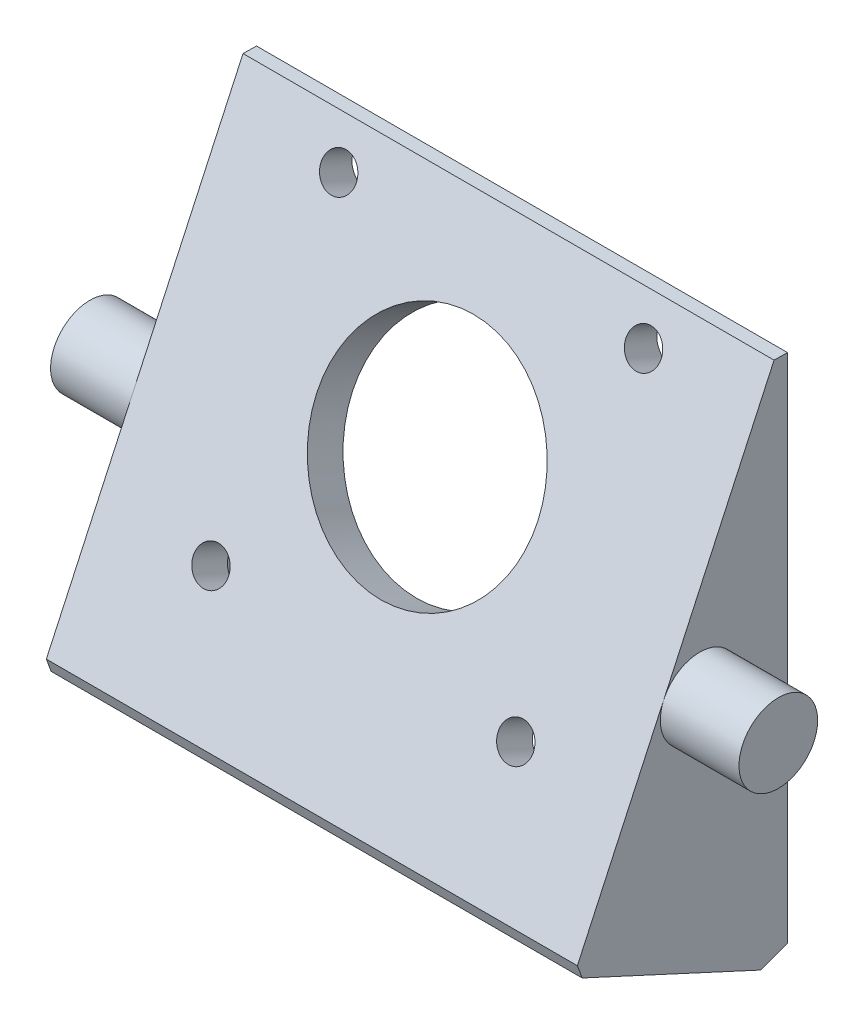
ISO-10303-21;
HEADER;
FILE_DESCRIPTION(('STEP AP214'),'2;1');
FILE_NAME('part.step','',(''),(''),'','','');
FILE_SCHEMA(('AUTOMOTIVE_DESIGN { 1 0 10303 214 1 1 1 1 }'));
ENDSEC;
DATA;
#1=APPLICATION_CONTEXT('core data for automotive mechanical design processes');
#2=APPLICATION_PROTOCOL_DEFINITION('international standard','automotive_design',2000,#1);
#3=PRODUCT_CONTEXT('',#1,'mechanical');
#4=PRODUCT('Part','Part','',(#3));
#5=PRODUCT_RELATED_PRODUCT_CATEGORY('part','',(#4));
#6=PRODUCT_DEFINITION_FORMATION('','',#4);
#7=PRODUCT_DEFINITION_CONTEXT('part definition',#1,'design');
#8=PRODUCT_DEFINITION('design','',#6,#7);
#9=PRODUCT_DEFINITION_SHAPE('','',#8);
#10=(LENGTH_UNIT() NAMED_UNIT(*) SI_UNIT(.MILLI.,.METRE.));
#11=(NAMED_UNIT(*) PLANE_ANGLE_UNIT() SI_UNIT($,.RADIAN.));
#12=(NAMED_UNIT(*) SI_UNIT($,.STERADIAN.) SOLID_ANGLE_UNIT());
#13=UNCERTAINTY_MEASURE_WITH_UNIT(LENGTH_MEASURE(1.E-05),#10,'distance_accuracy_value','');
#14=(GEOMETRIC_REPRESENTATION_CONTEXT(3) GLOBAL_UNCERTAINTY_ASSIGNED_CONTEXT((#13)) GLOBAL_UNIT_ASSIGNED_CONTEXT((#10,
#11,#12)) REPRESENTATION_CONTEXT('',''));
#15=CARTESIAN_POINT('',(0.,0.,0.));
#16=DIRECTION('',(0.,0.,1.));
#17=DIRECTION('',(1.,0.,0.));
#18=AXIS2_PLACEMENT_3D('',#15,#16,#17);
#19=CARTESIAN_POINT('',(27.,28.6356421265527,0.));
#20=DIRECTION('',(0.,0.,1.));
#21=DIRECTION('',(1.,0.,0.));
#22=AXIS2_PLACEMENT_3D('',#19,#20,#21);
#23=PLANE('',#22);
#24=DIRECTION('',(0.,1.,0.));
#25=VECTOR('',#24,1.);
#26=CARTESIAN_POINT('',(27.,28.6356421265527,0.));
#27=LINE('',#26,#25);
#28=CARTESIAN_POINT('',(27.,-26.3749335376143,0.));
#29=VERTEX_POINT('',#28);
#30=CARTESIAN_POINT('',(27.,25.6356421265527,0.));
#31=VERTEX_POINT('',#30);
#32=EDGE_CURVE('E189',#29,#31,#27,.T.);
#33=ORIENTED_EDGE('',*,*,#32,.F.);
#34=DIRECTION('',(-1.,0.,0.));
#35=VECTOR('',#34,1.);
#36=CARTESIAN_POINT('',(27.,-26.3749335376143,0.));
#37=LINE('',#36,#35);
#38=CARTESIAN_POINT('',(-27.,-26.3749335376143,0.));
#39=VERTEX_POINT('',#38);
#40=EDGE_CURVE('E215',#29,#39,#37,.T.);
#41=ORIENTED_EDGE('',*,*,#40,.T.);
#42=DIRECTION('',(0.,1.,0.));
#43=VECTOR('',#42,1.);
#44=CARTESIAN_POINT('',(-27.,28.6356421265527,0.));
#45=LINE('',#44,#43);
#46=CARTESIAN_POINT('',(-27.,25.6356421265527,0.));
#47=VERTEX_POINT('',#46);
#48=EDGE_CURVE('E180',#39,#47,#45,.T.);
#49=ORIENTED_EDGE('',*,*,#48,.T.);
#50=DIRECTION('',(1.,0.,0.));
#51=VECTOR('',#50,1.);
#52=CARTESIAN_POINT('',(27.,25.6356421265527,0.));
#53=LINE('',#52,#51);
#54=EDGE_CURVE('E211',#47,#31,#53,.T.);
#55=ORIENTED_EDGE('',*,*,#54,.T.);
#56=EDGE_LOOP('',(#33,#41,#49,#55));
#57=FACE_BOUND('',#56,.T.);
#58=DIRECTION('',(-1.,0.,0.));
#59=VECTOR('',#58,1.);
#60=CARTESIAN_POINT('',(27.,19.0904280843685,0.));
#61=LINE('',#60,#59);
#62=CARTESIAN_POINT('',(14.1292743203365,19.0904280843685,0.));
#63=VERTEX_POINT('',#62);
#64=CARTESIAN_POINT('',(-14.1292743203365,19.0904280843685,0.));
#65=VERTEX_POINT('',#64);
#66=EDGE_CURVE('E291',#63,#65,#61,.T.);
#67=ORIENTED_EDGE('',*,*,#66,.T.);
#68=CARTESIAN_POINT('',(-15.5,20.3753607438933,0.));
#69=DIRECTION('',(0.,0.,1.));
#70=DIRECTION('',(0.,-1.,0.));
#71=AXIS2_PLACEMENT_3D('',#68,#69,#70);
#72=ELLIPSE('',#71,1.98246753183826,1.8);
#73=CARTESIAN_POINT('',(-16.8707256796635,19.0904280843685,0.));
#74=VERTEX_POINT('',#73);
#75=EDGE_CURVE('E338',#74,#65,#72,.F.);
#76=ORIENTED_EDGE('',*,*,#75,.F.);
#77=CARTESIAN_POINT('',(-21.,19.0904280843685,0.));
#78=VERTEX_POINT('',#77);
#79=EDGE_CURVE('E292',#74,#78,#61,.T.);
#80=ORIENTED_EDGE('',*,*,#79,.T.);
#81=CARTESIAN_POINT('',(-21.,14.3178210632763,0.));
#82=DIRECTION('',(0.,0.,1.));
#83=DIRECTION('',(0.,1.,0.));
#84=AXIS2_PLACEMENT_3D('',#81,#82,#83);
#85=ELLIPSE('',#84,4.77260702109212,2.);
#86=CARTESIAN_POINT('',(-23.,14.3178210632763,0.));
#87=VERTEX_POINT('',#86);
#88=EDGE_CURVE('E246',#78,#87,#85,.T.);
#89=ORIENTED_EDGE('',*,*,#88,.T.);
#90=DIRECTION('',(0.,1.,0.));
#91=VECTOR('',#90,1.);
#92=CARTESIAN_POINT('',(-23.,28.6356421265527,0.));
#93=LINE('',#92,#91);
#94=CARTESIAN_POINT('',(-23.,-22.0274170204251,0.));
#95=VERTEX_POINT('',#94);
#96=EDGE_CURVE('E185',#95,#87,#93,.T.);
#97=ORIENTED_EDGE('',*,*,#96,.F.);
#98=CARTESIAN_POINT('',(-21.,-22.0274170204251,0.));
#99=DIRECTION('',(0.,0.,1.));
#100=DIRECTION('',(0.,1.,0.));
#101=AXIS2_PLACEMENT_3D('',#98,#99,#100);
#102=ELLIPSE('',#101,2.20274170204252,2.);
#103=CARTESIAN_POINT('',(-21.,-24.2301587224677,0.));
#104=VERTEX_POINT('',#103);
#105=EDGE_CURVE('E244',#95,#104,#102,.T.);
#106=ORIENTED_EDGE('',*,*,#105,.T.);
#107=DIRECTION('',(-1.,0.,0.));
#108=VECTOR('',#107,1.);
#109=CARTESIAN_POINT('',(27.,-24.2301587224677,0.));
#110=LINE('',#109,#108);
#111=CARTESIAN_POINT('',(21.,-24.2301587224677,0.));
#112=VERTEX_POINT('',#111);
#113=EDGE_CURVE('E290',#112,#104,#110,.T.);
#114=ORIENTED_EDGE('',*,*,#113,.F.);
#115=CARTESIAN_POINT('',(21.,-22.0274170204251,0.));
#116=DIRECTION('',(0.,0.,1.));
#117=DIRECTION('',(0.,-1.,0.));
#118=AXIS2_PLACEMENT_3D('',#115,#116,#117);
#119=ELLIPSE('',#118,2.20274170204252,2.);
#120=CARTESIAN_POINT('',(23.,-22.0274170204251,0.));
#121=VERTEX_POINT('',#120);
#122=EDGE_CURVE('E13',#112,#121,#119,.T.);
#123=ORIENTED_EDGE('',*,*,#122,.T.);
#124=DIRECTION('',(0.,1.,0.));
#125=VECTOR('',#124,1.);
#126=CARTESIAN_POINT('',(23.,28.6356421265527,0.));
#127=LINE('',#126,#125);
#128=CARTESIAN_POINT('',(23.,14.3178210632763,0.));
#129=VERTEX_POINT('',#128);
#130=EDGE_CURVE('E293',#121,#129,#127,.T.);
#131=ORIENTED_EDGE('',*,*,#130,.T.);
#132=CARTESIAN_POINT('',(21.,14.3178210632763,0.));
#133=DIRECTION('',(0.,0.,1.));
#134=DIRECTION('',(0.,-1.,0.));
#135=AXIS2_PLACEMENT_3D('',#132,#133,#134);
#136=ELLIPSE('',#135,4.77260702109212,2.);
#137=CARTESIAN_POINT('',(21.,19.0904280843685,0.));
#138=VERTEX_POINT('',#137);
#139=EDGE_CURVE('E57',#129,#138,#136,.T.);
#140=ORIENTED_EDGE('',*,*,#139,.T.);
#141=CARTESIAN_POINT('',(16.8707256796635,19.0904280843685,0.));
#142=VERTEX_POINT('',#141);
#143=EDGE_CURVE('E288',#138,#142,#61,.T.);
#144=ORIENTED_EDGE('',*,*,#143,.T.);
#145=CARTESIAN_POINT('',(15.5,20.3753607438933,0.));
#146=DIRECTION('',(0.,0.,1.));
#147=DIRECTION('',(0.,-1.,0.));
#148=AXIS2_PLACEMENT_3D('',#145,#146,#147);
#149=ELLIPSE('',#148,1.98246753183827,1.80000000000001);
#150=EDGE_CURVE('E330',#63,#142,#149,.F.);
#151=ORIENTED_EDGE('',*,*,#150,.F.);
#152=EDGE_LOOP('',(#67,#76,#80,#89,#97,#106,#114,#123,#131,#140,#144,#151));
#153=FACE_BOUND('',#152,.T.);
#154=ADVANCED_FACE('F48',(#57,#153),#23,.F.);
#155=CARTESIAN_POINT('',(27.,-18.5782458674708,21.7910252280109));
#156=DIRECTION('',(0.,-0.419058177461747,-0.907959384500452));
#157=DIRECTION('',(0.,0.907959384500452,-0.419058177461747));
#158=AXIS2_PLACEMENT_3D('',#155,#156,#157);
#159=PLANE('',#158);
#160=CARTESIAN_POINT('',(15.5,-6.32079417671467,16.1337398322773));
#161=DIRECTION('',(0.,-0.419058177461747,-0.907959384500452));
#162=DIRECTION('',(0.,0.907959384500452,-0.419058177461747));
#163=AXIS2_PLACEMENT_3D('',#160,#161,#162);
#164=CIRCLE('',#163,1.8);
#165=CARTESIAN_POINT('',(15.5,-4.68646728461386,15.3794351128461));
#166=VERTEX_POINT('',#165);
#167=EDGE_CURVE('E270',#166,#166,#164,.F.);
#168=ORIENTED_EDGE('',*,*,#167,.F.);
#169=EDGE_LOOP('',(#168));
#170=FACE_BOUND('',#169,.T.);
#171=CARTESIAN_POINT('',(-15.5,-6.32079417671467,16.1337398322773));
#172=DIRECTION('',(0.,-0.419058177461747,-0.907959384500452));
#173=DIRECTION('',(0.,0.907959384500452,-0.419058177461747));
#174=AXIS2_PLACEMENT_3D('',#171,#172,#173);
#175=CIRCLE('',#174,1.8);
#176=CARTESIAN_POINT('',(-15.5,-4.68646728461386,15.3794351128461));
#177=VERTEX_POINT('',#176);
#178=EDGE_CURVE('E278',#177,#177,#175,.F.);
#179=ORIENTED_EDGE('',*,*,#178,.F.);
#180=EDGE_LOOP('',(#179));
#181=FACE_BOUND('',#180,.T.);
#182=CARTESIAN_POINT('',(-15.5,21.8259467427993,3.1429363309631));
#183=DIRECTION('',(0.,-0.419058177461747,-0.907959384500452));
#184=DIRECTION('',(0.,0.907959384500452,-0.419058177461747));
#185=AXIS2_PLACEMENT_3D('',#182,#183,#184);
#186=CIRCLE('',#185,1.8);
#187=CARTESIAN_POINT('',(-15.5,23.4602736349001,2.38863161153196));
#188=VERTEX_POINT('',#187);
#189=EDGE_CURVE('E334',#188,#188,#186,.F.);
#190=ORIENTED_EDGE('',*,*,#189,.F.);
#191=EDGE_LOOP('',(#190));
#192=FACE_BOUND('',#191,.T.);
#193=CARTESIAN_POINT('',(15.5,21.8259467427993,3.1429363309631));
#194=DIRECTION('',(0.,-0.419058177461747,-0.907959384500452));
#195=DIRECTION('',(0.,0.907959384500452,-0.419058177461747));
#196=AXIS2_PLACEMENT_3D('',#193,#194,#195);
#197=CIRCLE('',#196,1.80000000000001);
#198=CARTESIAN_POINT('',(15.5,23.4602736349002,2.38863161153195));
#199=VERTEX_POINT('',#198);
#200=EDGE_CURVE('E285',#199,#199,#197,.F.);
#201=ORIENTED_EDGE('',*,*,#200,.F.);
#202=EDGE_LOOP('',(#201));
#203=FACE_BOUND('',#202,.T.);
#204=CARTESIAN_POINT('',(0.,7.75257628304233,9.63833808162018));
#205=DIRECTION('',(0.,-0.419058177461747,-0.907959384500452));
#206=DIRECTION('',(0.,0.907959384500452,-0.419058177461747));
#207=AXIS2_PLACEMENT_3D('',#204,#205,#206);
#208=CIRCLE('',#207,11.25);
#209=CARTESIAN_POINT('',(0.,17.9671193586724,4.92393358517553));
#210=VERTEX_POINT('',#209);
#211=EDGE_CURVE('E284',#210,#210,#208,.F.);
#212=ORIENTED_EDGE('',*,*,#211,.F.);
#213=EDGE_LOOP('',(#212));
#214=FACE_BOUND('',#213,.T.);
#215=DIRECTION('',(0.,-0.907959384500452,0.419058177461747));
#216=VECTOR('',#215,1.);
#217=CARTESIAN_POINT('',(27.,-18.5782458674708,21.7910252280109));
#218=LINE('',#217,#216);
#219=CARTESIAN_POINT('',(27.,25.6596175277527,1.37354981483078));
#220=VERTEX_POINT('',#219);
#221=CARTESIAN_POINT('',(27.,1.39686059153917,12.5717453238524));
#222=VERTEX_POINT('',#221);
#223=EDGE_CURVE('E162',#220,#222,#218,.T.);
#224=ORIENTED_EDGE('',*,*,#223,.F.);
#225=DIRECTION('',(-1.,0.,0.));
#226=VECTOR('',#225,1.);
#227=CARTESIAN_POINT('',(27.,25.6596175277527,1.37354981483078));
#228=LINE('',#227,#226);
#229=CARTESIAN_POINT('',(-27.,25.6596175277527,1.37354981483078));
#230=VERTEX_POINT('',#229);
#231=EDGE_CURVE('E206',#220,#230,#228,.T.);
#232=ORIENTED_EDGE('',*,*,#231,.T.);
#233=DIRECTION('',(0.,-0.907959384500452,0.419058177461747));
#234=VECTOR('',#233,1.);
#235=CARTESIAN_POINT('',(-27.,-18.5782458674708,21.7910252280109));
#236=LINE('',#235,#234);
#237=CARTESIAN_POINT('',(-27.,1.39686059153917,12.5717453238524));
#238=VERTEX_POINT('',#237);
#239=EDGE_CURVE('E192',#230,#238,#236,.T.);
#240=ORIENTED_EDGE('',*,*,#239,.T.);
#241=CARTESIAN_POINT('',(-27.,-17.6702864829703,21.3719670505491));
#242=VERTEX_POINT('',#241);
#243=EDGE_CURVE('E195',#238,#242,#236,.T.);
#244=ORIENTED_EDGE('',*,*,#243,.T.);
#245=DIRECTION('',(1.,0.,0.));
#246=VECTOR('',#245,1.);
#247=CARTESIAN_POINT('',(27.,-17.6702864829703,21.3719670505491));
#248=LINE('',#247,#246);
#249=CARTESIAN_POINT('',(27.,-17.6702864829703,21.3719670505491));
#250=VERTEX_POINT('',#249);
#251=EDGE_CURVE('E178',#242,#250,#248,.T.);
#252=ORIENTED_EDGE('',*,*,#251,.T.);
#253=EDGE_CURVE('E173',#222,#250,#218,.T.);
#254=ORIENTED_EDGE('',*,*,#253,.F.);
#255=EDGE_LOOP('',(#224,#232,#240,#244,#252,#254));
#256=FACE_BOUND('',#255,.T.);
#257=ADVANCED_FACE('F176',(#170,#181,#192,#203,#214,#256),#159,.F.);
#258=CARTESIAN_POINT('',(27.,-28.6356421265527,0.));
#259=DIRECTION('',(0.,0.907959384500452,-0.419058177461747));
#260=DIRECTION('',(0.,0.419058177461747,0.907959384500452));
#261=AXIS2_PLACEMENT_3D('',#258,#259,#260);
#262=PLANE('',#261);
#263=DIRECTION('',(0.,-0.419058177461747,-0.907959384500452));
#264=VECTOR('',#263,1.);
#265=CARTESIAN_POINT('',(-27.,-28.6356421265527,0.));
#266=LINE('',#265,#264);
#267=CARTESIAN_POINT('',(-27.,-18.9973040449325,20.8830658435104));
#268=VERTEX_POINT('',#267);
#269=CARTESIAN_POINT('',(-27.,-27.3784675941674,2.72387815350138));
#270=VERTEX_POINT('',#269);
#271=EDGE_CURVE('E181',#268,#270,#266,.T.);
#272=ORIENTED_EDGE('',*,*,#271,.T.);
#273=DIRECTION('',(1.,0.,0.));
#274=VECTOR('',#273,1.);
#275=CARTESIAN_POINT('',(27.,-27.3784675941674,2.72387815350138));
#276=LINE('',#275,#274);
#277=CARTESIAN_POINT('',(27.,-27.3784675941674,2.72387815350138));
#278=VERTEX_POINT('',#277);
#279=EDGE_CURVE('E220',#270,#278,#276,.T.);
#280=ORIENTED_EDGE('',*,*,#279,.T.);
#281=DIRECTION('',(0.,-0.419058177461747,-0.907959384500452));
#282=VECTOR('',#281,1.);
#283=CARTESIAN_POINT('',(27.,-28.6356421265527,0.));
#284=LINE('',#283,#282);
#285=CARTESIAN_POINT('',(27.,-18.9973040449325,20.8830658435104));
#286=VERTEX_POINT('',#285);
#287=EDGE_CURVE('E172',#286,#278,#284,.T.);
#288=ORIENTED_EDGE('',*,*,#287,.F.);
#289=DIRECTION('',(-1.,0.,0.));
#290=VECTOR('',#289,1.);
#291=CARTESIAN_POINT('',(27.,-18.9973040449325,20.8830658435104));
#292=LINE('',#291,#290);
#293=EDGE_CURVE('E191',#286,#268,#292,.T.);
#294=ORIENTED_EDGE('',*,*,#293,.T.);
#295=EDGE_LOOP('',(#272,#280,#288,#294));
#296=FACE_BOUND('',#295,.T.);
#297=ADVANCED_FACE('F310',(#296),#262,.F.);
#298=CARTESIAN_POINT('',(27.,0.,0.));
#299=DIRECTION('',(1.,0.,0.));
#300=DIRECTION('',(0.,0.,-1.));
#301=AXIS2_PLACEMENT_3D('',#298,#299,#300);
#302=PLANE('',#301);
#303=ORIENTED_EDGE('',*,*,#223,.T.);
#304=CARTESIAN_POINT('',(27.,-0.279372118307818,8.9399077858506));
#305=DIRECTION('',(1.,0.,0.));
#306=DIRECTION('',(0.,0.,-1.));
#307=AXIS2_PLACEMENT_3D('',#304,#305,#306);
#308=CIRCLE('',#307,4.);
#309=EDGE_CURVE('E166',#222,#222,#308,.T.);
#310=ORIENTED_EDGE('',*,*,#309,.F.);
#311=ORIENTED_EDGE('',*,*,#253,.T.);
#312=DIRECTION('',(0.,0.938343116817111,0.345705358827355));
#313=VECTOR('',#312,1.);
#314=CARTESIAN_POINT('',(27.,-9.04467233021601,24.5498248963007));
#315=LINE('',#314,#313);
#316=EDGE_CURVE('E204',#250,#286,#315,.F.);
#317=ORIENTED_EDGE('',*,*,#316,.T.);
#318=ORIENTED_EDGE('',*,*,#287,.T.);
#319=DIRECTION('',(0.,-0.345705358827357,0.93834311681711));
#320=VECTOR('',#319,1.);
#321=CARTESIAN_POINT('',(27.,-23.2228073343384,-8.55577112317734));
#322=LINE('',#321,#320);
#323=EDGE_CURVE('E222',#278,#29,#322,.F.);
#324=ORIENTED_EDGE('',*,*,#323,.T.);
#325=ORIENTED_EDGE('',*,*,#32,.T.);
#326=DIRECTION('',(0.,-0.0174524064372765,-0.999847695156391));
#327=VECTOR('',#326,1.);
#328=CARTESIAN_POINT('',(27.,25.6278338562869,-0.44733550393088));
#329=LINE('',#328,#327);
#330=EDGE_CURVE('E168',#31,#220,#329,.F.);
#331=ORIENTED_EDGE('',*,*,#330,.T.);
#332=EDGE_LOOP('',(#303,#310,#311,#317,#318,#324,#325,#331));
#333=FACE_BOUND('',#332,.T.);
#334=ADVANCED_FACE('F164',(#333),#302,.T.);
#335=CARTESIAN_POINT('',(-27.,0.,0.));
#336=DIRECTION('',(1.,0.,0.));
#337=DIRECTION('',(0.,0.,-1.));
#338=AXIS2_PLACEMENT_3D('',#335,#336,#337);
#339=PLANE('',#338);
#340=ORIENTED_EDGE('',*,*,#243,.F.);
#341=CARTESIAN_POINT('',(-27.,-0.279372118307818,8.9399077858506));
#342=DIRECTION('',(1.,0.,0.));
#343=DIRECTION('',(0.,0.,-1.));
#344=AXIS2_PLACEMENT_3D('',#341,#342,#343);
#345=CIRCLE('',#344,4.);
#346=EDGE_CURVE('E63',#238,#238,#345,.T.);
#347=ORIENTED_EDGE('',*,*,#346,.T.);
#348=ORIENTED_EDGE('',*,*,#239,.F.);
#349=DIRECTION('',(0.,0.0174524064372765,0.999847695156391));
#350=VECTOR('',#349,1.);
#351=CARTESIAN_POINT('',(-27.,25.6596175277527,1.37354981483078));
#352=LINE('',#351,#350);
#353=EDGE_CURVE('E208',#230,#47,#352,.F.);
#354=ORIENTED_EDGE('',*,*,#353,.T.);
#355=ORIENTED_EDGE('',*,*,#48,.F.);
#356=DIRECTION('',(0.,0.345705358827357,-0.93834311681711));
#357=VECTOR('',#356,1.);
#358=CARTESIAN_POINT('',(-27.,-26.3749335376143,0.));
#359=LINE('',#358,#357);
#360=EDGE_CURVE('E218',#39,#270,#359,.F.);
#361=ORIENTED_EDGE('',*,*,#360,.T.);
#362=ORIENTED_EDGE('',*,*,#271,.F.);
#363=DIRECTION('',(0.,-0.938343116817111,-0.345705358827355));
#364=VECTOR('',#363,1.);
#365=CARTESIAN_POINT('',(-27.,-18.9973040449325,20.8830658435104));
#366=LINE('',#365,#364);
#367=EDGE_CURVE('E200',#268,#242,#366,.F.);
#368=ORIENTED_EDGE('',*,*,#367,.T.);
#369=EDGE_LOOP('',(#340,#347,#348,#354,#355,#361,#362,#368));
#370=FACE_BOUND('',#369,.T.);
#371=ADVANCED_FACE('F303',(#370),#339,.F.);
#372=CARTESIAN_POINT('',(27.,-20.2544785773178,18.159187690009));
#373=DIRECTION('',(0.,-0.419058177461747,-0.907959384500452));
#374=DIRECTION('',(0.,0.907959384500452,-0.419058177461747));
#375=AXIS2_PLACEMENT_3D('',#372,#373,#374);
#376=PLANE('',#375);
#377=CARTESIAN_POINT('',(15.5,-7.99702688656166,12.5019022942755));
#378=DIRECTION('',(0.,-0.419058177461747,-0.907959384500452));
#379=DIRECTION('',(0.,0.907959384500452,-0.419058177461747));
#380=AXIS2_PLACEMENT_3D('',#377,#378,#379);
#381=CIRCLE('',#380,1.8);
#382=CARTESIAN_POINT('',(15.5,-6.36269999446084,11.7475975748443));
#383=VERTEX_POINT('',#382);
#384=EDGE_CURVE('E267',#383,#383,#381,.T.);
#385=ORIENTED_EDGE('',*,*,#384,.F.);
#386=EDGE_LOOP('',(#385));
#387=FACE_BOUND('',#386,.T.);
#388=CARTESIAN_POINT('',(-15.5,-7.99702688656166,12.5019022942755));
#389=DIRECTION('',(0.,-0.419058177461747,-0.907959384500452));
#390=DIRECTION('',(0.,0.907959384500452,-0.419058177461747));
#391=AXIS2_PLACEMENT_3D('',#388,#389,#390);
#392=CIRCLE('',#391,1.8);
#393=CARTESIAN_POINT('',(-15.5,-6.36269999446085,11.7475975748443));
#394=VERTEX_POINT('',#393);
#395=EDGE_CURVE('E275',#394,#394,#392,.T.);
#396=ORIENTED_EDGE('',*,*,#395,.F.);
#397=EDGE_LOOP('',(#396));
#398=FACE_BOUND('',#397,.T.);
#399=DIRECTION('',(-1.,0.,0.));
#400=VECTOR('',#399,1.);
#401=CARTESIAN_POINT('',(-23.,-14.806722270315,15.6448386252386));
#402=LINE('',#401,#400);
#403=CARTESIAN_POINT('',(21.,-14.806722270315,15.6448386252386));
#404=VERTEX_POINT('',#403);
#405=CARTESIAN_POINT('',(-21.,-14.806722270315,15.6448386252386));
#406=VERTEX_POINT('',#405);
#407=EDGE_CURVE('E237',#404,#406,#402,.T.);
#408=ORIENTED_EDGE('',*,*,#407,.T.);
#409=DIRECTION('',(0.,-0.907959384500452,0.419058177461747));
#410=VECTOR('',#409,1.);
#411=CARTESIAN_POINT('',(-21.,19.0904280843685,0.));
#412=LINE('',#411,#410);
#413=EDGE_CURVE('E239',#406,#78,#412,.F.);
#414=ORIENTED_EDGE('',*,*,#413,.T.);
#415=ORIENTED_EDGE('',*,*,#79,.F.);
#416=CARTESIAN_POINT('',(-15.5,20.1497140329523,-0.488901207038706));
#417=DIRECTION('',(0.,-0.419058177461747,-0.907959384500452));
#418=DIRECTION('',(0.,0.907959384500452,-0.419058177461747));
#419=AXIS2_PLACEMENT_3D('',#416,#417,#418);
#420=CIRCLE('',#419,1.8);
#421=EDGE_CURVE('E340',#65,#74,#420,.T.);
#422=ORIENTED_EDGE('',*,*,#421,.F.);
#423=ORIENTED_EDGE('',*,*,#66,.F.);
#424=CARTESIAN_POINT('',(15.5,20.1497140329523,-0.488901207038706));
#425=DIRECTION('',(0.,-0.419058177461747,-0.907959384500452));
#426=DIRECTION('',(0.,0.907959384500452,-0.419058177461747));
#427=AXIS2_PLACEMENT_3D('',#424,#425,#426);
#428=CIRCLE('',#427,1.80000000000001);
#429=EDGE_CURVE('E333',#142,#63,#428,.T.);
#430=ORIENTED_EDGE('',*,*,#429,.F.);
#431=ORIENTED_EDGE('',*,*,#143,.F.);
#432=DIRECTION('',(0.,-0.907959384500452,0.419058177461747));
#433=VECTOR('',#432,1.);
#434=CARTESIAN_POINT('',(21.,-20.2544785773178,18.159187690009));
#435=LINE('',#434,#433);
#436=EDGE_CURVE('E235',#138,#404,#435,.T.);
#437=ORIENTED_EDGE('',*,*,#436,.T.);
#438=EDGE_LOOP('',(#408,#414,#415,#422,#423,#430,#431,#437));
#439=FACE_BOUND('',#438,.T.);
#440=CARTESIAN_POINT('',(0.,6.07634357319534,6.00650054361838));
#441=DIRECTION('',(0.,-0.419058177461747,-0.907959384500452));
#442=DIRECTION('',(0.,0.907959384500452,-0.419058177461747));
#443=AXIS2_PLACEMENT_3D('',#440,#441,#442);
#444=CIRCLE('',#443,11.25);
#445=CARTESIAN_POINT('',(0.,16.2908866488254,1.29209604717372));
#446=VERTEX_POINT('',#445);
#447=EDGE_CURVE('E281',#446,#446,#444,.T.);
#448=ORIENTED_EDGE('',*,*,#447,.F.);
#449=EDGE_LOOP('',(#448));
#450=FACE_BOUND('',#449,.T.);
#451=ADVANCED_FACE('F428',(#387,#398,#439,#450),#376,.T.);
#452=CARTESIAN_POINT('',(27.,-25.0038045885509,-1.67623270984698));
#453=DIRECTION('',(0.,0.907959384500452,-0.419058177461747));
#454=DIRECTION('',(0.,0.419058177461747,0.907959384500452));
#455=AXIS2_PLACEMENT_3D('',#452,#453,#454);
#456=PLANE('',#455);
#457=ORIENTED_EDGE('',*,*,#113,.T.);
#458=DIRECTION('',(0.,-0.419058177461747,-0.907959384500452));
#459=VECTOR('',#458,1.);
#460=CARTESIAN_POINT('',(-21.,-16.622641039316,16.4829549801621));
#461=LINE('',#460,#459);
#462=CARTESIAN_POINT('',(-21.,-17.4607573942395,14.6670362111611));
#463=VERTEX_POINT('',#462);
#464=EDGE_CURVE('E233',#104,#463,#461,.F.);
#465=ORIENTED_EDGE('',*,*,#464,.T.);
#466=DIRECTION('',(-1.,0.,0.));
#467=VECTOR('',#466,1.);
#468=CARTESIAN_POINT('',(23.,-17.4607573942394,14.6670362111611));
#469=LINE('',#468,#467);
#470=CARTESIAN_POINT('',(21.,-17.4607573942395,14.6670362111611));
#471=VERTEX_POINT('',#470);
#472=EDGE_CURVE('E231',#463,#471,#469,.F.);
#473=ORIENTED_EDGE('',*,*,#472,.T.);
#474=DIRECTION('',(0.,-0.419058177461747,-0.907959384500452));
#475=VECTOR('',#474,1.);
#476=CARTESIAN_POINT('',(21.,-25.0038045885509,-1.67623270984698));
#477=LINE('',#476,#475);
#478=EDGE_CURVE('E229',#471,#112,#477,.T.);
#479=ORIENTED_EDGE('',*,*,#478,.T.);
#480=EDGE_LOOP('',(#457,#465,#473,#479));
#481=FACE_BOUND('',#480,.T.);
#482=ADVANCED_FACE('F447',(#481),#456,.T.);
#483=CARTESIAN_POINT('',(23.,0.,0.));
#484=DIRECTION('',(1.,0.,0.));
#485=DIRECTION('',(0.,0.,-1.));
#486=AXIS2_PLACEMENT_3D('',#483,#484,#485);
#487=PLANE('',#486);
#488=DIRECTION('',(0.,-0.419058177461747,-0.907959384500452));
#489=VECTOR('',#488,1.);
#490=CARTESIAN_POINT('',(23.,-18.159187690009,8.38116354923493));
#491=LINE('',#490,#489);
#492=CARTESIAN_POINT('',(23.,-15.6448386252385,13.8289198562377));
#493=VERTEX_POINT('',#492);
#494=EDGE_CURVE('E70',#121,#493,#491,.F.);
#495=ORIENTED_EDGE('',*,*,#494,.T.);
#496=DIRECTION('',(0.,-0.907959384500452,0.419058177461747));
#497=VECTOR('',#496,1.);
#498=CARTESIAN_POINT('',(23.,2.51434906477048,5.44775630700271));
#499=LINE('',#498,#497);
#500=EDGE_CURVE('E242',#493,#129,#499,.F.);
#501=ORIENTED_EDGE('',*,*,#500,.T.);
#502=ORIENTED_EDGE('',*,*,#130,.F.);
#503=EDGE_LOOP('',(#495,#501,#502));
#504=FACE_BOUND('',#503,.T.);
#505=ADVANCED_FACE('F374',(#504),#487,.F.);
#506=CARTESIAN_POINT('',(-23.,0.,0.));
#507=DIRECTION('',(1.,0.,0.));
#508=DIRECTION('',(0.,0.,-1.));
#509=AXIS2_PLACEMENT_3D('',#506,#507,#508);
#510=PLANE('',#509);
#511=DIRECTION('',(0.,-0.907959384500452,0.419058177461747));
#512=VECTOR('',#511,1.);
#513=CARTESIAN_POINT('',(-23.,-17.4607573942395,14.6670362111612));
#514=LINE('',#513,#512);
#515=CARTESIAN_POINT('',(-23.,-15.6448386252385,13.8289198562377));
#516=VERTEX_POINT('',#515);
#517=EDGE_CURVE('E224',#87,#516,#514,.T.);
#518=ORIENTED_EDGE('',*,*,#517,.T.);
#519=DIRECTION('',(0.,-0.419058177461747,-0.907959384500452));
#520=VECTOR('',#519,1.);
#521=CARTESIAN_POINT('',(-23.,-22.4142399534668,-0.838116354923491));
#522=LINE('',#521,#520);
#523=EDGE_CURVE('E226',#516,#95,#522,.T.);
#524=ORIENTED_EDGE('',*,*,#523,.T.);
#525=ORIENTED_EDGE('',*,*,#96,.T.);
#526=EDGE_LOOP('',(#518,#524,#525));
#527=FACE_BOUND('',#526,.T.);
#528=ADVANCED_FACE('F364',(#527),#510,.T.);
#529=CARTESIAN_POINT('',(0.,16.0443517356513,27.603851562273));
#530=DIRECTION('',(0.,-0.419058177461747,-0.907959384500452));
#531=DIRECTION('',(0.,0.907959384500452,-0.419058177461747));
#532=AXIS2_PLACEMENT_3D('',#529,#530,#531);
#533=CYLINDRICAL_SURFACE('',#532,11.25);
#534=ORIENTED_EDGE('',*,*,#447,.T.);
#535=EDGE_LOOP('',(#534));
#536=FACE_BOUND('',#535,.T.);
#537=ORIENTED_EDGE('',*,*,#211,.T.);
#538=EDGE_LOOP('',(#537));
#539=FACE_BOUND('',#538,.T.);
#540=ADVANCED_FACE('F361',(#536,#539),#533,.F.);
#541=CARTESIAN_POINT('',(15.5,30.1177221954083,21.1084498116159));
#542=DIRECTION('',(0.,-0.419058177461747,-0.907959384500452));
#543=DIRECTION('',(0.,0.907959384500452,-0.419058177461747));
#544=AXIS2_PLACEMENT_3D('',#541,#542,#543);
#545=CYLINDRICAL_SURFACE('',#544,1.80000000000001);
#546=ORIENTED_EDGE('',*,*,#200,.T.);
#547=EDGE_LOOP('',(#546));
#548=FACE_BOUND('',#547,.T.);
#549=ORIENTED_EDGE('',*,*,#150,.T.);
#550=ORIENTED_EDGE('',*,*,#429,.T.);
#551=EDGE_LOOP('',(#549,#550));
#552=FACE_BOUND('',#551,.T.);
#553=ADVANCED_FACE('F363',(#548,#552),#545,.F.);
#554=CARTESIAN_POINT('',(-15.5,30.1177221954083,21.1084498116159));
#555=DIRECTION('',(0.,-0.419058177461747,-0.907959384500452));
#556=DIRECTION('',(0.,0.907959384500452,-0.419058177461747));
#557=AXIS2_PLACEMENT_3D('',#554,#555,#556);
#558=CYLINDRICAL_SURFACE('',#557,1.8);
#559=ORIENTED_EDGE('',*,*,#189,.T.);
#560=EDGE_LOOP('',(#559));
#561=FACE_BOUND('',#560,.T.);
#562=ORIENTED_EDGE('',*,*,#75,.T.);
#563=ORIENTED_EDGE('',*,*,#421,.T.);
#564=EDGE_LOOP('',(#562,#563));
#565=FACE_BOUND('',#564,.T.);
#566=ADVANCED_FACE('F371',(#561,#565),#558,.F.);
#567=CARTESIAN_POINT('',(-15.5,1.97098127589434,34.0992533129301));
#568=DIRECTION('',(0.,-0.419058177461747,-0.907959384500452));
#569=DIRECTION('',(0.,0.907959384500452,-0.419058177461747));
#570=AXIS2_PLACEMENT_3D('',#567,#568,#569);
#571=CYLINDRICAL_SURFACE('',#570,1.8);
#572=ORIENTED_EDGE('',*,*,#395,.T.);
#573=EDGE_LOOP('',(#572));
#574=FACE_BOUND('',#573,.T.);
#575=ORIENTED_EDGE('',*,*,#178,.T.);
#576=EDGE_LOOP('',(#575));
#577=FACE_BOUND('',#576,.T.);
#578=ADVANCED_FACE('F349',(#574,#577),#571,.F.);
#579=CARTESIAN_POINT('',(15.5,1.97098127589434,34.0992533129301));
#580=DIRECTION('',(0.,-0.419058177461747,-0.907959384500452));
#581=DIRECTION('',(0.,0.907959384500452,-0.419058177461747));
#582=AXIS2_PLACEMENT_3D('',#579,#580,#581);
#583=CYLINDRICAL_SURFACE('',#582,1.8);
#584=ORIENTED_EDGE('',*,*,#384,.T.);
#585=EDGE_LOOP('',(#584));
#586=FACE_BOUND('',#585,.T.);
#587=ORIENTED_EDGE('',*,*,#167,.T.);
#588=EDGE_LOOP('',(#587));
#589=FACE_BOUND('',#588,.T.);
#590=ADVANCED_FACE('F390',(#586,#589),#583,.F.);
#591=CARTESIAN_POINT('',(27.,-18.9973040449325,20.8830658435104));
#592=DIRECTION('',(0.,0.345705358827355,-0.938343116817111));
#593=DIRECTION('',(-1.,0.,0.));
#594=AXIS2_PLACEMENT_3D('',#591,#592,#593);
#595=PLANE('',#594);
#596=ORIENTED_EDGE('',*,*,#316,.F.);
#597=ORIENTED_EDGE('',*,*,#251,.F.);
#598=ORIENTED_EDGE('',*,*,#367,.F.);
#599=ORIENTED_EDGE('',*,*,#293,.F.);
#600=EDGE_LOOP('',(#596,#597,#598,#599));
#601=FACE_BOUND('',#600,.T.);
#602=ADVANCED_FACE('F306',(#601),#595,.F.);
#603=CARTESIAN_POINT('',(27.,25.6596175277527,1.37354981483078));
#604=DIRECTION('',(0.,-0.999847695156391,0.0174524064372765));
#605=DIRECTION('',(-1.,0.,0.));
#606=AXIS2_PLACEMENT_3D('',#603,#604,#605);
#607=PLANE('',#606);
#608=ORIENTED_EDGE('',*,*,#330,.F.);
#609=ORIENTED_EDGE('',*,*,#54,.F.);
#610=ORIENTED_EDGE('',*,*,#353,.F.);
#611=ORIENTED_EDGE('',*,*,#231,.F.);
#612=EDGE_LOOP('',(#608,#609,#610,#611));
#613=FACE_BOUND('',#612,.T.);
#614=ADVANCED_FACE('F321',(#613),#607,.F.);
#615=CARTESIAN_POINT('',(27.,-26.3749335376143,0.));
#616=DIRECTION('',(0.,0.93834311681711,0.345705358827357));
#617=DIRECTION('',(-1.,0.,0.));
#618=AXIS2_PLACEMENT_3D('',#615,#616,#617);
#619=PLANE('',#618);
#620=ORIENTED_EDGE('',*,*,#323,.F.);
#621=ORIENTED_EDGE('',*,*,#279,.F.);
#622=ORIENTED_EDGE('',*,*,#360,.F.);
#623=ORIENTED_EDGE('',*,*,#40,.F.);
#624=EDGE_LOOP('',(#620,#621,#622,#623));
#625=FACE_BOUND('',#624,.T.);
#626=ADVANCED_FACE('F313',(#625),#619,.F.);
#627=CARTESIAN_POINT('',(21.,-23.18788581955,-2.51434906477047));
#628=DIRECTION('',(0.,-0.419058177461747,-0.907959384500452));
#629=DIRECTION('',(0.,0.907959384500452,-0.419058177461747));
#630=AXIS2_PLACEMENT_3D('',#627,#628,#629);
#631=CYLINDRICAL_SURFACE('',#630,2.);
#632=ORIENTED_EDGE('',*,*,#122,.F.);
#633=ORIENTED_EDGE('',*,*,#478,.F.);
#634=CARTESIAN_POINT('',(21.,-15.6448386252385,13.8289198562377));
#635=DIRECTION('',(0.,-0.419058177461748,-0.907959384500451));
#636=DIRECTION('',(0.,0.907959384500451,-0.419058177461748));
#637=AXIS2_PLACEMENT_3D('',#634,#635,#636);
#638=CIRCLE('',#637,2.);
#639=EDGE_CURVE('E52',#493,#471,#638,.T.);
#640=ORIENTED_EDGE('',*,*,#639,.F.);
#641=ORIENTED_EDGE('',*,*,#494,.F.);
#642=EDGE_LOOP('',(#632,#633,#640,#641));
#643=FACE_BOUND('',#642,.T.);
#644=ADVANCED_FACE('F50',(#643),#631,.F.);
#645=CARTESIAN_POINT('',(21.,-21.0925949322413,16.3432689210081));
#646=DIRECTION('',(0.,-0.907959384500452,0.419058177461747));
#647=DIRECTION('',(0.,-0.419058177461747,-0.907959384500452));
#648=AXIS2_PLACEMENT_3D('',#645,#646,#647);
#649=CYLINDRICAL_SURFACE('',#648,2.);
#650=ORIENTED_EDGE('',*,*,#139,.F.);
#651=ORIENTED_EDGE('',*,*,#500,.F.);
#652=CARTESIAN_POINT('',(21.,-15.6448386252385,13.8289198562377));
#653=DIRECTION('',(0.,0.907959384500451,-0.419058177461747));
#654=DIRECTION('',(0.,0.419058177461747,0.907959384500452));
#655=AXIS2_PLACEMENT_3D('',#652,#653,#654);
#656=CIRCLE('',#655,2.);
#657=EDGE_CURVE('E261',#404,#493,#656,.T.);
#658=ORIENTED_EDGE('',*,*,#657,.F.);
#659=ORIENTED_EDGE('',*,*,#436,.F.);
#660=EDGE_LOOP('',(#650,#651,#658,#659));
#661=FACE_BOUND('',#660,.T.);
#662=ADVANCED_FACE('F414',(#661),#649,.F.);
#663=CARTESIAN_POINT('',(21.,-15.6448386252385,13.8289198562377));
#664=DIRECTION('',(0.,0.,1.));
#665=DIRECTION('',(1.,0.,0.));
#666=AXIS2_PLACEMENT_3D('',#663,#664,#665);
#667=SPHERICAL_SURFACE('',#666,2.);
#668=ORIENTED_EDGE('',*,*,#657,.T.);
#669=ORIENTED_EDGE('',*,*,#639,.T.);
#670=CARTESIAN_POINT('',(21.,-15.6448386252385,13.8289198562377));
#671=DIRECTION('',(-1.,0.,0.));
#672=DIRECTION('',(0.,0.,1.));
#673=AXIS2_PLACEMENT_3D('',#670,#671,#672);
#674=CIRCLE('',#673,2.);
#675=EDGE_CURVE('E259',#404,#471,#674,.F.);
#676=ORIENTED_EDGE('',*,*,#675,.F.);
#677=EDGE_LOOP('',(#668,#669,#676));
#678=FACE_BOUND('',#677,.T.);
#679=ADVANCED_FACE('F411',(#678),#667,.F.);
#680=CARTESIAN_POINT('',(27.,-15.6448386252385,13.8289198562377));
#681=DIRECTION('',(1.,0.,0.));
#682=DIRECTION('',(0.,0.,-1.));
#683=AXIS2_PLACEMENT_3D('',#680,#681,#682);
#684=CYLINDRICAL_SURFACE('',#683,2.);
#685=ORIENTED_EDGE('',*,*,#675,.T.);
#686=ORIENTED_EDGE('',*,*,#472,.F.);
#687=CARTESIAN_POINT('',(-21.,-15.6448386252385,13.8289198562377));
#688=DIRECTION('',(1.,0.,0.));
#689=DIRECTION('',(0.,0.,-1.));
#690=AXIS2_PLACEMENT_3D('',#687,#688,#689);
#691=CIRCLE('',#690,2.);
#692=EDGE_CURVE('E256',#406,#463,#691,.T.);
#693=ORIENTED_EDGE('',*,*,#692,.F.);
#694=ORIENTED_EDGE('',*,*,#407,.F.);
#695=EDGE_LOOP('',(#685,#686,#693,#694));
#696=FACE_BOUND('',#695,.T.);
#697=ADVANCED_FACE('F407',(#696),#684,.F.);
#698=CARTESIAN_POINT('',(-21.,2.51434906477048,5.44775630700271));
#699=DIRECTION('',(0.,0.907959384500452,-0.419058177461747));
#700=DIRECTION('',(0.,0.419058177461747,0.907959384500452));
#701=AXIS2_PLACEMENT_3D('',#698,#699,#700);
#702=CYLINDRICAL_SURFACE('',#701,2.);
#703=ORIENTED_EDGE('',*,*,#88,.F.);
#704=ORIENTED_EDGE('',*,*,#413,.F.);
#705=CARTESIAN_POINT('',(-21.,-15.6448386252385,13.8289198562377));
#706=DIRECTION('',(0.,0.907959384500451,-0.419058177461748));
#707=DIRECTION('',(0.,0.419058177461748,0.907959384500451));
#708=AXIS2_PLACEMENT_3D('',#705,#706,#707);
#709=CIRCLE('',#708,2.);
#710=EDGE_CURVE('E252',#516,#406,#709,.T.);
#711=ORIENTED_EDGE('',*,*,#710,.F.);
#712=ORIENTED_EDGE('',*,*,#517,.F.);
#713=EDGE_LOOP('',(#703,#704,#711,#712));
#714=FACE_BOUND('',#713,.T.);
#715=ADVANCED_FACE('F403',(#714),#702,.F.);
#716=CARTESIAN_POINT('',(-21.,-15.6448386252385,13.8289198562377));
#717=DIRECTION('',(0.,0.,1.));
#718=DIRECTION('',(1.,0.,0.));
#719=AXIS2_PLACEMENT_3D('',#716,#717,#718);
#720=SPHERICAL_SURFACE('',#719,2.);
#721=ORIENTED_EDGE('',*,*,#710,.T.);
#722=ORIENTED_EDGE('',*,*,#692,.T.);
#723=CARTESIAN_POINT('',(-21.,-15.6448386252385,13.8289198562377));
#724=DIRECTION('',(0.,-0.419058177461746,-0.907959384500452));
#725=DIRECTION('',(0.,0.907959384500452,-0.419058177461747));
#726=AXIS2_PLACEMENT_3D('',#723,#724,#725);
#727=CIRCLE('',#726,2.);
#728=EDGE_CURVE('E249',#516,#463,#727,.F.);
#729=ORIENTED_EDGE('',*,*,#728,.F.);
#730=EDGE_LOOP('',(#721,#722,#729));
#731=FACE_BOUND('',#730,.T.);
#732=ADVANCED_FACE('F399',(#731),#720,.F.);
#733=CARTESIAN_POINT('',(-21.,-18.159187690009,8.38116354923493));
#734=DIRECTION('',(0.,0.419058177461747,0.907959384500452));
#735=DIRECTION('',(0.,-0.907959384500452,0.419058177461747));
#736=AXIS2_PLACEMENT_3D('',#733,#734,#735);
#737=CYLINDRICAL_SURFACE('',#736,2.);
#738=ORIENTED_EDGE('',*,*,#728,.T.);
#739=ORIENTED_EDGE('',*,*,#464,.F.);
#740=ORIENTED_EDGE('',*,*,#105,.F.);
#741=ORIENTED_EDGE('',*,*,#523,.F.);
#742=EDGE_LOOP('',(#738,#739,#740,#741));
#743=FACE_BOUND('',#742,.T.);
#744=ADVANCED_FACE('F395',(#743),#737,.F.);
#745=CARTESIAN_POINT('',(35.,-0.279372118307818,8.9399077858506));
#746=DIRECTION('',(-1.,0.,0.));
#747=DIRECTION('',(0.,0.,1.));
#748=AXIS2_PLACEMENT_3D('',#745,#746,#747);
#749=CYLINDRICAL_SURFACE('',#748,4.);
#750=CARTESIAN_POINT('',(35.,-0.279372118307818,8.9399077858506));
#751=DIRECTION('',(1.,0.,0.));
#752=DIRECTION('',(0.,0.,-1.));
#753=AXIS2_PLACEMENT_3D('',#750,#751,#752);
#754=CIRCLE('',#753,4.);
#755=CARTESIAN_POINT('',(35.,-0.279372118307818,4.9399077858506));
#756=VERTEX_POINT('',#755);
#757=EDGE_CURVE('E253',#756,#756,#754,.T.);
#758=ORIENTED_EDGE('',*,*,#757,.F.);
#759=EDGE_LOOP('',(#758));
#760=FACE_BOUND('',#759,.T.);
#761=ORIENTED_EDGE('',*,*,#309,.T.);
#762=EDGE_LOOP('',(#761));
#763=FACE_BOUND('',#762,.T.);
#764=ADVANCED_FACE('F398',(#760,#763),#749,.T.);
#765=CARTESIAN_POINT('',(35.,-0.279372118307818,8.9399077858506));
#766=DIRECTION('',(1.,0.,0.));
#767=DIRECTION('',(0.,0.,-1.));
#768=AXIS2_PLACEMENT_3D('',#765,#766,#767);
#769=PLANE('',#768);
#770=ORIENTED_EDGE('',*,*,#757,.T.);
#771=EDGE_LOOP('',(#770));
#772=FACE_BOUND('',#771,.T.);
#773=ADVANCED_FACE('F538',(#772),#769,.T.);
#774=CARTESIAN_POINT('',(-35.,-0.279372118307818,8.9399077858506));
#775=DIRECTION('',(1.,0.,0.));
#776=DIRECTION('',(0.,0.,-1.));
#777=AXIS2_PLACEMENT_3D('',#774,#775,#776);
#778=CYLINDRICAL_SURFACE('',#777,4.);
#779=CARTESIAN_POINT('',(-35.,-0.279372118307818,8.9399077858506));
#780=DIRECTION('',(1.,0.,0.));
#781=DIRECTION('',(0.,0.,-1.));
#782=AXIS2_PLACEMENT_3D('',#779,#780,#781);
#783=CIRCLE('',#782,4.);
#784=CARTESIAN_POINT('',(-35.,-0.279372118307818,4.9399077858506));
#785=VERTEX_POINT('',#784);
#786=EDGE_CURVE('E322',#785,#785,#783,.T.);
#787=ORIENTED_EDGE('',*,*,#786,.T.);
#788=EDGE_LOOP('',(#787));
#789=FACE_BOUND('',#788,.T.);
#790=ORIENTED_EDGE('',*,*,#346,.F.);
#791=EDGE_LOOP('',(#790));
#792=FACE_BOUND('',#791,.T.);
#793=ADVANCED_FACE('F548',(#789,#792),#778,.T.);
#794=CARTESIAN_POINT('',(-35.,-0.279372118307818,8.9399077858506));
#795=DIRECTION('',(-1.,0.,0.));
#796=DIRECTION('',(0.,0.,-1.));
#797=AXIS2_PLACEMENT_3D('',#794,#795,#796);
#798=PLANE('',#797);
#799=ORIENTED_EDGE('',*,*,#786,.F.);
#800=EDGE_LOOP('',(#799));
#801=FACE_BOUND('',#800,.T.);
#802=ADVANCED_FACE('F568',(#801),#798,.T.);
#803=CLOSED_SHELL('',(#154,#257,#297,#334,#371,#451,#482,#505,#528,#540,#553,#566,#578,#590,
#602,#614,#626,#644,#662,#679,#697,#715,#732,#744,#764,#773,#793,#802));
#804=MANIFOLD_SOLID_BREP('B2',#803);
#805=ADVANCED_BREP_SHAPE_REPRESENTATION('',(#18,#804),#14);
#806=SHAPE_DEFINITION_REPRESENTATION(#9,#805);
ENDSEC;
END-ISO-10303-21;
